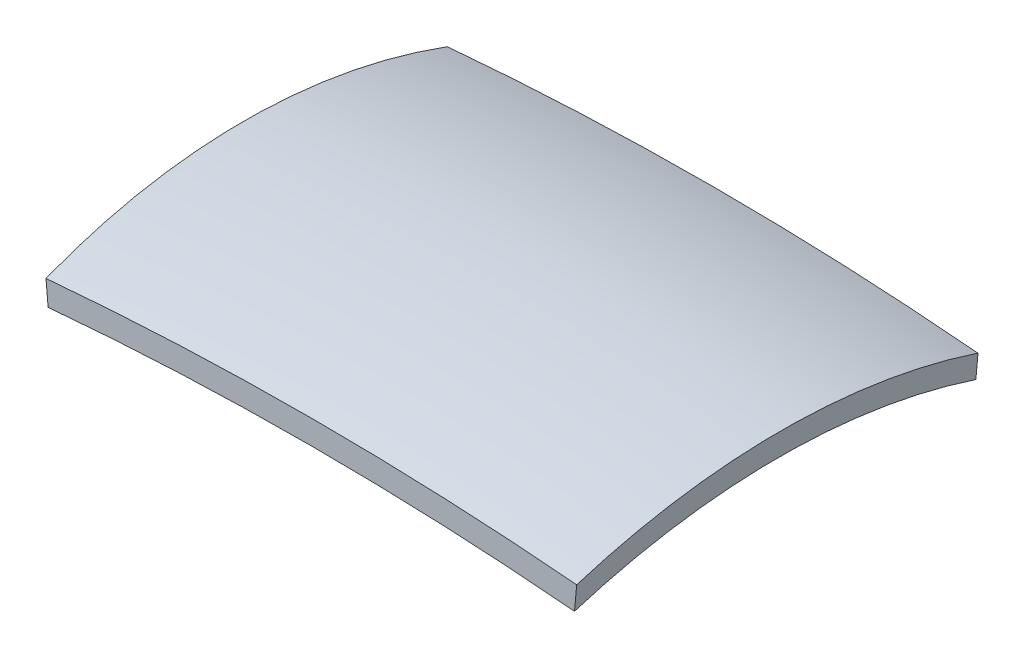
ISO-10303-21;
HEADER;
FILE_DESCRIPTION(('STEP AP214'),'2;1');
FILE_NAME('part.step','',(''),(''),'','','');
FILE_SCHEMA(('AUTOMOTIVE_DESIGN { 1 0 10303 214 1 1 1 1 }'));
ENDSEC;
DATA;
#1=APPLICATION_CONTEXT('core data for automotive mechanical design processes');
#2=APPLICATION_PROTOCOL_DEFINITION('international standard','automotive_design',2000,#1);
#3=PRODUCT_CONTEXT('',#1,'mechanical');
#4=PRODUCT('Part','Part','',(#3));
#5=PRODUCT_RELATED_PRODUCT_CATEGORY('part','',(#4));
#6=PRODUCT_DEFINITION_FORMATION('','',#4);
#7=PRODUCT_DEFINITION_CONTEXT('part definition',#1,'design');
#8=PRODUCT_DEFINITION('design','',#6,#7);
#9=PRODUCT_DEFINITION_SHAPE('','',#8);
#10=(LENGTH_UNIT() NAMED_UNIT(*) SI_UNIT(.MILLI.,.METRE.));
#11=(NAMED_UNIT(*) PLANE_ANGLE_UNIT() SI_UNIT($,.RADIAN.));
#12=(NAMED_UNIT(*) SI_UNIT($,.STERADIAN.) SOLID_ANGLE_UNIT());
#13=UNCERTAINTY_MEASURE_WITH_UNIT(LENGTH_MEASURE(1.E-05),#10,'distance_accuracy_value','');
#14=(GEOMETRIC_REPRESENTATION_CONTEXT(3) GLOBAL_UNCERTAINTY_ASSIGNED_CONTEXT((#13)) GLOBAL_UNIT_ASSIGNED_CONTEXT((#10,
#11,#12)) REPRESENTATION_CONTEXT('',''));
#15=CARTESIAN_POINT('',(0.,0.,0.));
#16=DIRECTION('',(0.,0.,1.));
#17=DIRECTION('',(1.,0.,0.));
#18=AXIS2_PLACEMENT_3D('',#15,#16,#17);
#19=CARTESIAN_POINT('',(-261.906640927323,-1348.93608113371,-500.));
#20=DIRECTION('',(0.996102918043345,0.0881985071615896,0.));
#21=DIRECTION('',(-0.0881985071615896,0.996102918043345,0.));
#22=AXIS2_PLACEMENT_3D('',#19,#20,#21);
#23=PLANE('',#22);
#24=CARTESIAN_POINT('',(-261.906640927323,-1348.93608113371,-500.));
#25=DIRECTION('',(0.996102918043345,0.0881985071615896,0.));
#26=DIRECTION('',(-0.0881985071615896,0.996102918043345,0.));
#27=AXIS2_PLACEMENT_3D('',#24,#25,#26);
#28=CIRCLE('',#27,1500.);
#29=CARTESIAN_POINT('',(-386.638165936303,59.7661750826011,-1000.));
#30=VERTEX_POINT('',#29);
#31=CARTESIAN_POINT('',(-386.638165936303,59.7661750826011,0.));
#32=VERTEX_POINT('',#31);
#33=EDGE_CURVE('E75',#30,#32,#28,.T.);
#34=ORIENTED_EDGE('',*,*,#33,.F.);
#35=DIRECTION('',(-0.08819850716159,0.996102918043345,0.));
#36=VECTOR('',#35,1.);
#37=CARTESIAN_POINT('',(-381.346255506608,0.,-1000.));
#38=LINE('',#37,#36);
#39=CARTESIAN_POINT('',(-381.346255506608,0.,-1000.));
#40=VERTEX_POINT('',#39);
#41=EDGE_CURVE('E63',#40,#30,#38,.T.);
#42=ORIENTED_EDGE('',*,*,#41,.F.);
#43=CARTESIAN_POINT('',(-256.614730497627,-1408.70225621631,-500.));
#44=DIRECTION('',(-0.996102918043345,-0.0881985071615896,0.));
#45=DIRECTION('',(-0.0881985071615896,0.996102918043345,0.));
#46=AXIS2_PLACEMENT_3D('',#43,#44,#45);
#47=CIRCLE('',#46,1500.);
#48=CARTESIAN_POINT('',(-381.346255506608,0.,0.));
#49=VERTEX_POINT('',#48);
#50=EDGE_CURVE('E68',#49,#40,#47,.T.);
#51=ORIENTED_EDGE('',*,*,#50,.F.);
#52=DIRECTION('',(0.08819850716159,-0.996102918043345,0.));
#53=VECTOR('',#52,1.);
#54=CARTESIAN_POINT('',(-381.346255506608,0.,0.));
#55=LINE('',#54,#53);
#56=EDGE_CURVE('E72',#32,#49,#55,.T.);
#57=ORIENTED_EDGE('',*,*,#56,.F.);
#58=EDGE_LOOP('',(#34,#42,#51,#57));
#59=FACE_BOUND('',#58,.T.);
#60=ADVANCED_FACE('F33',(#59),#23,.F.);
#61=CARTESIAN_POINT('',(810.814129914107,-1348.93608113371,-500.));
#62=DIRECTION('',(0.996102918043345,-0.0881985071615897,0.));
#63=DIRECTION('',(0.0881985071615897,0.996102918043345,0.));
#64=AXIS2_PLACEMENT_3D('',#61,#62,#63);
#65=PLANE('',#64);
#66=CARTESIAN_POINT('',(810.814129914107,-1348.93608113371,-500.));
#67=DIRECTION('',(0.996102918043345,-0.0881985071615897,0.));
#68=DIRECTION('',(0.0881985071615897,0.996102918043345,0.));
#69=AXIS2_PLACEMENT_3D('',#66,#67,#68);
#70=CIRCLE('',#69,1500.);
#71=CARTESIAN_POINT('',(935.545654923087,59.7661750826012,-1000.));
#72=VERTEX_POINT('',#71);
#73=CARTESIAN_POINT('',(935.545654923087,59.7661750826012,0.));
#74=VERTEX_POINT('',#73);
#75=EDGE_CURVE('E89',#72,#74,#70,.T.);
#76=ORIENTED_EDGE('',*,*,#75,.T.);
#77=DIRECTION('',(-0.0881985071615893,-0.996102918043345,0.));
#78=VECTOR('',#77,1.);
#79=CARTESIAN_POINT('',(930.253744493392,0.,0.));
#80=LINE('',#79,#78);
#81=CARTESIAN_POINT('',(930.253744493392,4.78783679369599E-13,0.));
#82=VERTEX_POINT('',#81);
#83=EDGE_CURVE('E52',#74,#82,#80,.T.);
#84=ORIENTED_EDGE('',*,*,#83,.T.);
#85=CARTESIAN_POINT('',(805.522219484411,-1408.70225621631,-500.));
#86=DIRECTION('',(-0.996102918043345,0.0881985071615897,0.));
#87=DIRECTION('',(0.0881985071615897,0.996102918043345,0.));
#88=AXIS2_PLACEMENT_3D('',#85,#86,#87);
#89=CIRCLE('',#88,1500.);
#90=CARTESIAN_POINT('',(930.253744493392,4.78783679369599E-13,-1000.));
#91=VERTEX_POINT('',#90);
#92=EDGE_CURVE('E46',#82,#91,#89,.T.);
#93=ORIENTED_EDGE('',*,*,#92,.T.);
#94=DIRECTION('',(0.0881985071615893,0.996102918043345,0.));
#95=VECTOR('',#94,1.);
#96=CARTESIAN_POINT('',(930.253744493392,0.,-1000.));
#97=LINE('',#96,#95);
#98=EDGE_CURVE('E11',#91,#72,#97,.T.);
#99=ORIENTED_EDGE('',*,*,#98,.T.);
#100=EDGE_LOOP('',(#76,#84,#93,#99));
#101=FACE_BOUND('',#100,.T.);
#102=ADVANCED_FACE('F114',(#101),#65,.T.);
#103=CARTESIAN_POINT('',(274.453744493392,-7406.52324711129,-500.));
#104=DIRECTION('',(0.,0.,-1.));
#105=DIRECTION('',(-1.,0.,0.));
#106=AXIS2_PLACEMENT_3D('',#103,#104,#105);
#107=TOROIDAL_SURFACE('',#106,6081.28643762691,1500.);
#108=CARTESIAN_POINT('',(274.453744493392,-7406.52324711129,0.));
#109=DIRECTION('',(0.,0.,-1.));
#110=DIRECTION('',(-0.0881985071615897,0.996102918043345,0.));
#111=AXIS2_PLACEMENT_3D('',#108,#109,#110);
#112=CIRCLE('',#111,7495.5);
#113=EDGE_CURVE('E91',#32,#74,#112,.T.);
#114=ORIENTED_EDGE('',*,*,#113,.T.);
#115=ORIENTED_EDGE('',*,*,#75,.F.);
#116=CARTESIAN_POINT('',(274.453744493392,-7406.52324711129,-1000.));
#117=DIRECTION('',(0.,0.,-1.));
#118=DIRECTION('',(-0.0881985071615897,0.996102918043345,0.));
#119=AXIS2_PLACEMENT_3D('',#116,#117,#118);
#120=CIRCLE('',#119,7495.5);
#121=EDGE_CURVE('E85',#30,#72,#120,.T.);
#122=ORIENTED_EDGE('',*,*,#121,.F.);
#123=ORIENTED_EDGE('',*,*,#33,.T.);
#124=EDGE_LOOP('',(#114,#115,#122,#123));
#125=FACE_BOUND('',#124,.T.);
#126=ADVANCED_FACE('F88',(#125),#107,.T.);
#127=CARTESIAN_POINT('',(-381.346255506608,0.,0.));
#128=DIRECTION('',(0.,0.,1.));
#129=DIRECTION('',(1.,0.,0.));
#130=AXIS2_PLACEMENT_3D('',#127,#128,#129);
#131=PLANE('',#130);
#132=CARTESIAN_POINT('',(274.453744493392,-7406.52324711129,0.));
#133=DIRECTION('',(0.,0.,-1.));
#134=DIRECTION('',(-0.0881985071615897,0.996102918043345,0.));
#135=AXIS2_PLACEMENT_3D('',#132,#133,#134);
#136=CIRCLE('',#135,7435.5);
#137=EDGE_CURVE('E97',#49,#82,#136,.T.);
#138=ORIENTED_EDGE('',*,*,#137,.T.);
#139=ORIENTED_EDGE('',*,*,#83,.F.);
#140=ORIENTED_EDGE('',*,*,#113,.F.);
#141=ORIENTED_EDGE('',*,*,#56,.T.);
#142=EDGE_LOOP('',(#138,#139,#140,#141));
#143=FACE_BOUND('',#142,.T.);
#144=ADVANCED_FACE('F106',(#143),#131,.T.);
#145=CARTESIAN_POINT('',(274.453744493392,-7406.52324711129,-500.));
#146=DIRECTION('',(0.,0.,-1.));
#147=DIRECTION('',(-1.,0.,0.));
#148=AXIS2_PLACEMENT_3D('',#145,#146,#147);
#149=TOROIDAL_SURFACE('',#148,6021.2864376269,1500.);
#150=CARTESIAN_POINT('',(274.453744493392,-7406.52324711129,-1000.));
#151=DIRECTION('',(0.,0.,-1.));
#152=DIRECTION('',(-0.0881985071615897,0.996102918043345,0.));
#153=AXIS2_PLACEMENT_3D('',#150,#151,#152);
#154=CIRCLE('',#153,7435.5);
#155=EDGE_CURVE('E40',#40,#91,#154,.T.);
#156=ORIENTED_EDGE('',*,*,#155,.T.);
#157=ORIENTED_EDGE('',*,*,#92,.F.);
#158=ORIENTED_EDGE('',*,*,#137,.F.);
#159=ORIENTED_EDGE('',*,*,#50,.T.);
#160=EDGE_LOOP('',(#156,#157,#158,#159));
#161=FACE_BOUND('',#160,.T.);
#162=ADVANCED_FACE('F103',(#161),#149,.F.);
#163=CARTESIAN_POINT('',(-381.346255506608,0.,-1000.));
#164=DIRECTION('',(0.,0.,-1.));
#165=DIRECTION('',(-1.,0.,0.));
#166=AXIS2_PLACEMENT_3D('',#163,#164,#165);
#167=PLANE('',#166);
#168=ORIENTED_EDGE('',*,*,#98,.F.);
#169=ORIENTED_EDGE('',*,*,#155,.F.);
#170=ORIENTED_EDGE('',*,*,#41,.T.);
#171=ORIENTED_EDGE('',*,*,#121,.T.);
#172=EDGE_LOOP('',(#168,#169,#170,#171));
#173=FACE_BOUND('',#172,.T.);
#174=ADVANCED_FACE('F84',(#173),#167,.T.);
#175=CLOSED_SHELL('',(#60,#102,#126,#144,#162,#174));
#176=MANIFOLD_SOLID_BREP('B2',#175);
#177=ADVANCED_BREP_SHAPE_REPRESENTATION('',(#18,#176),#14);
#178=SHAPE_DEFINITION_REPRESENTATION(#9,#177);
ENDSEC;
END-ISO-10303-21;
